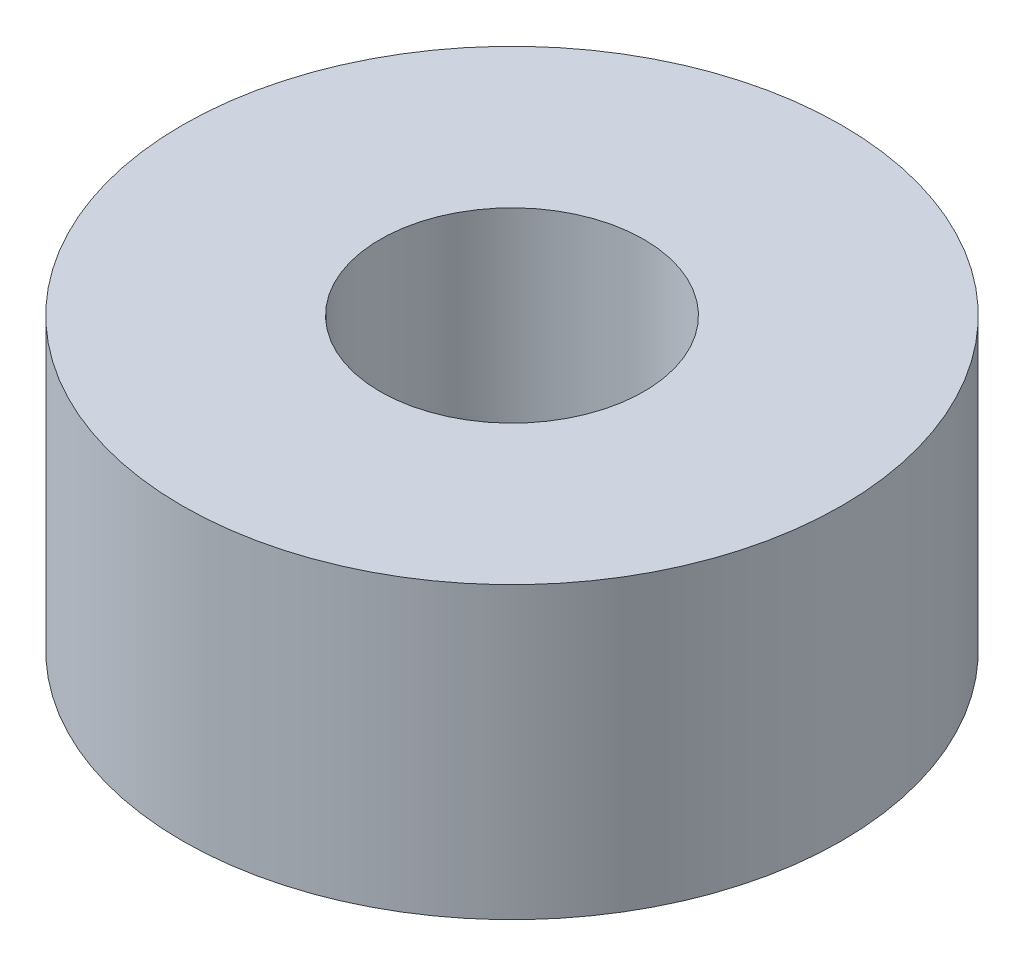
ISO-10303-21;
HEADER;
FILE_DESCRIPTION(('STEP AP214'),'2;1');
FILE_NAME('part.step','',(''),(''),'','','');
FILE_SCHEMA(('AUTOMOTIVE_DESIGN { 1 0 10303 214 1 1 1 1 }'));
ENDSEC;
DATA;
#1=APPLICATION_CONTEXT('core data for automotive mechanical design processes');
#2=APPLICATION_PROTOCOL_DEFINITION('international standard','automotive_design',2000,#1);
#3=PRODUCT_CONTEXT('',#1,'mechanical');
#4=PRODUCT('Part','Part','',(#3));
#5=PRODUCT_RELATED_PRODUCT_CATEGORY('part','',(#4));
#6=PRODUCT_DEFINITION_FORMATION('','',#4);
#7=PRODUCT_DEFINITION_CONTEXT('part definition',#1,'design');
#8=PRODUCT_DEFINITION('design','',#6,#7);
#9=PRODUCT_DEFINITION_SHAPE('','',#8);
#10=(LENGTH_UNIT() NAMED_UNIT(*) SI_UNIT(.MILLI.,.METRE.));
#11=(NAMED_UNIT(*) PLANE_ANGLE_UNIT() SI_UNIT($,.RADIAN.));
#12=(NAMED_UNIT(*) SI_UNIT($,.STERADIAN.) SOLID_ANGLE_UNIT());
#13=UNCERTAINTY_MEASURE_WITH_UNIT(LENGTH_MEASURE(1.E-05),#10,'distance_accuracy_value','');
#14=(GEOMETRIC_REPRESENTATION_CONTEXT(3) GLOBAL_UNCERTAINTY_ASSIGNED_CONTEXT((#13)) GLOBAL_UNIT_ASSIGNED_CONTEXT((#10,
#11,#12)) REPRESENTATION_CONTEXT('',''));
#15=CARTESIAN_POINT('',(0.,0.,0.));
#16=DIRECTION('',(0.,0.,1.));
#17=DIRECTION('',(1.,0.,0.));
#18=AXIS2_PLACEMENT_3D('',#15,#16,#17);
#19=CARTESIAN_POINT('',(0.,22.,0.));
#20=DIRECTION('',(0.,1.,0.));
#21=DIRECTION('',(0.,0.,1.));
#22=AXIS2_PLACEMENT_3D('',#19,#20,#21);
#23=PLANE('',#22);
#24=CARTESIAN_POINT('',(0.,22.,0.));
#25=DIRECTION('',(0.,1.,0.));
#26=DIRECTION('',(0.,0.,1.));
#27=AXIS2_PLACEMENT_3D('',#24,#25,#26);
#28=CIRCLE('',#27,25.);
#29=CARTESIAN_POINT('',(0.,22.,25.));
#30=VERTEX_POINT('',#29);
#31=EDGE_CURVE('E10',#30,#30,#28,.T.);
#32=ORIENTED_EDGE('',*,*,#31,.T.);
#33=EDGE_LOOP('',(#32));
#34=FACE_BOUND('',#33,.T.);
#35=CARTESIAN_POINT('',(0.,22.,0.));
#36=DIRECTION('',(0.,1.,0.));
#37=DIRECTION('',(0.,0.,1.));
#38=AXIS2_PLACEMENT_3D('',#35,#36,#37);
#39=CIRCLE('',#38,10.);
#40=CARTESIAN_POINT('',(0.,22.,10.));
#41=VERTEX_POINT('',#40);
#42=EDGE_CURVE('E41',#41,#41,#39,.T.);
#43=ORIENTED_EDGE('',*,*,#42,.F.);
#44=EDGE_LOOP('',(#43));
#45=FACE_BOUND('',#44,.T.);
#46=ADVANCED_FACE('F30',(#34,#45),#23,.T.);
#47=CARTESIAN_POINT('',(0.,0.,0.));
#48=DIRECTION('',(0.,1.,0.));
#49=DIRECTION('',(0.,0.,1.));
#50=AXIS2_PLACEMENT_3D('',#47,#48,#49);
#51=PLANE('',#50);
#52=CARTESIAN_POINT('',(0.,0.,0.));
#53=DIRECTION('',(0.,1.,0.));
#54=DIRECTION('',(0.,0.,1.));
#55=AXIS2_PLACEMENT_3D('',#52,#53,#54);
#56=CIRCLE('',#55,25.);
#57=CARTESIAN_POINT('',(0.,0.,25.));
#58=VERTEX_POINT('',#57);
#59=EDGE_CURVE('E34',#58,#58,#56,.T.);
#60=ORIENTED_EDGE('',*,*,#59,.F.);
#61=EDGE_LOOP('',(#60));
#62=FACE_BOUND('',#61,.T.);
#63=CARTESIAN_POINT('',(0.,0.,0.));
#64=DIRECTION('',(0.,1.,0.));
#65=DIRECTION('',(0.,0.,1.));
#66=AXIS2_PLACEMENT_3D('',#63,#64,#65);
#67=CIRCLE('',#66,10.);
#68=CARTESIAN_POINT('',(0.,0.,10.));
#69=VERTEX_POINT('',#68);
#70=EDGE_CURVE('E43',#69,#69,#67,.T.);
#71=ORIENTED_EDGE('',*,*,#70,.T.);
#72=EDGE_LOOP('',(#71));
#73=FACE_BOUND('',#72,.T.);
#74=ADVANCED_FACE('F53',(#62,#73),#51,.F.);
#75=CARTESIAN_POINT('',(0.,22.,0.));
#76=DIRECTION('',(0.,-1.,0.));
#77=DIRECTION('',(0.,0.,-1.));
#78=AXIS2_PLACEMENT_3D('',#75,#76,#77);
#79=CYLINDRICAL_SURFACE('',#78,25.);
#80=ORIENTED_EDGE('',*,*,#31,.F.);
#81=EDGE_LOOP('',(#80));
#82=FACE_BOUND('',#81,.T.);
#83=ORIENTED_EDGE('',*,*,#59,.T.);
#84=EDGE_LOOP('',(#83));
#85=FACE_BOUND('',#84,.T.);
#86=ADVANCED_FACE('F32',(#82,#85),#79,.T.);
#87=CARTESIAN_POINT('',(0.,22.,0.));
#88=DIRECTION('',(0.,-1.,0.));
#89=DIRECTION('',(0.,0.,-1.));
#90=AXIS2_PLACEMENT_3D('',#87,#88,#89);
#91=CYLINDRICAL_SURFACE('',#90,10.);
#92=ORIENTED_EDGE('',*,*,#42,.T.);
#93=EDGE_LOOP('',(#92));
#94=FACE_BOUND('',#93,.T.);
#95=ORIENTED_EDGE('',*,*,#70,.F.);
#96=EDGE_LOOP('',(#95));
#97=FACE_BOUND('',#96,.T.);
#98=ADVANCED_FACE('F49',(#94,#97),#91,.F.);
#99=CLOSED_SHELL('',(#46,#74,#86,#98));
#100=MANIFOLD_SOLID_BREP('B2',#99);
#101=ADVANCED_BREP_SHAPE_REPRESENTATION('',(#18,#100),#14);
#102=SHAPE_DEFINITION_REPRESENTATION(#9,#101);
ENDSEC;
END-ISO-10303-21;
